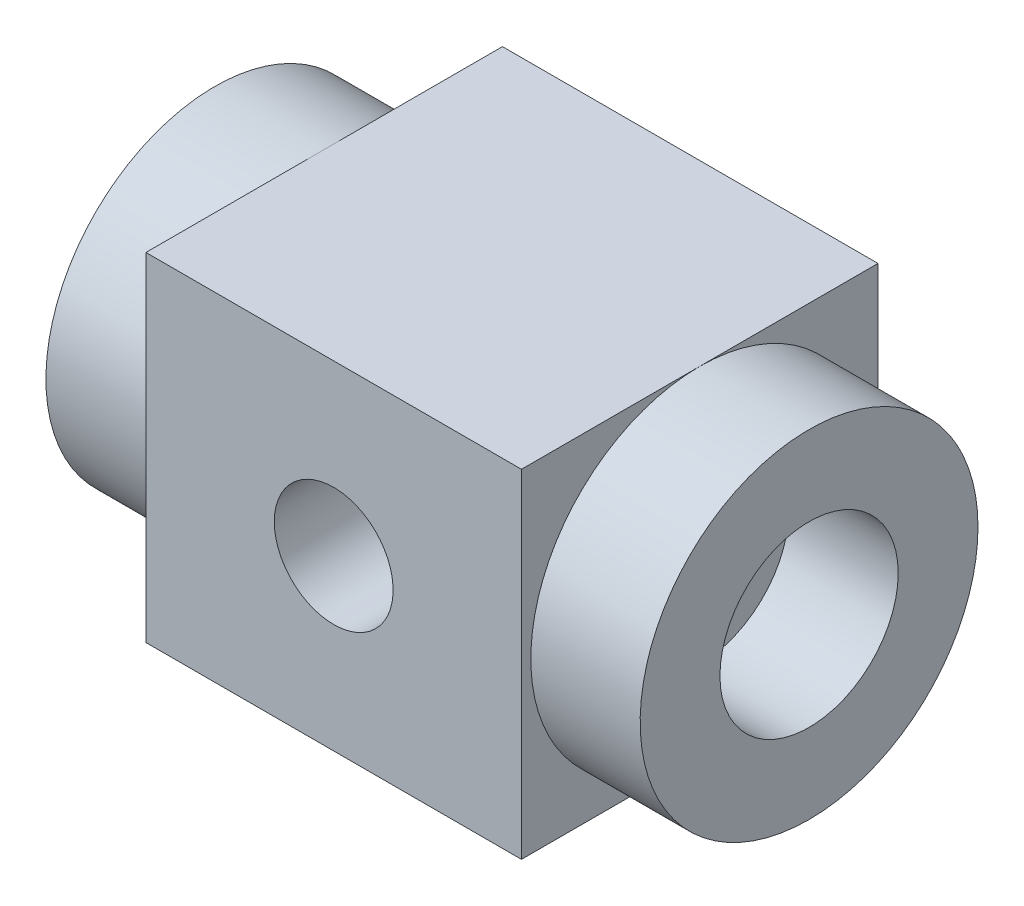
ISO-10303-21;
HEADER;
FILE_DESCRIPTION(('STEP AP214'),'2;1');
FILE_NAME('part.step','',(''),(''),'','','');
FILE_SCHEMA(('AUTOMOTIVE_DESIGN { 1 0 10303 214 1 1 1 1 }'));
ENDSEC;
DATA;
#1=APPLICATION_CONTEXT('core data for automotive mechanical design processes');
#2=APPLICATION_PROTOCOL_DEFINITION('international standard','automotive_design',2000,#1);
#3=PRODUCT_CONTEXT('',#1,'mechanical');
#4=PRODUCT('Part','Part','',(#3));
#5=PRODUCT_RELATED_PRODUCT_CATEGORY('part','',(#4));
#6=PRODUCT_DEFINITION_FORMATION('','',#4);
#7=PRODUCT_DEFINITION_CONTEXT('part definition',#1,'design');
#8=PRODUCT_DEFINITION('design','',#6,#7);
#9=PRODUCT_DEFINITION_SHAPE('','',#8);
#10=(LENGTH_UNIT() NAMED_UNIT(*) SI_UNIT(.MILLI.,.METRE.));
#11=(NAMED_UNIT(*) PLANE_ANGLE_UNIT() SI_UNIT($,.RADIAN.));
#12=(NAMED_UNIT(*) SI_UNIT($,.STERADIAN.) SOLID_ANGLE_UNIT());
#13=UNCERTAINTY_MEASURE_WITH_UNIT(LENGTH_MEASURE(1.E-05),#10,'distance_accuracy_value','');
#14=(GEOMETRIC_REPRESENTATION_CONTEXT(3) GLOBAL_UNCERTAINTY_ASSIGNED_CONTEXT((#13)) GLOBAL_UNIT_ASSIGNED_CONTEXT((#10,
#11,#12)) REPRESENTATION_CONTEXT('',''));
#15=CARTESIAN_POINT('',(0.,0.,0.));
#16=DIRECTION('',(0.,0.,1.));
#17=DIRECTION('',(1.,0.,0.));
#18=AXIS2_PLACEMENT_3D('',#15,#16,#17);
#19=CARTESIAN_POINT('',(-50.,0.,15.));
#20=DIRECTION('',(1.,0.,0.));
#21=DIRECTION('',(0.,0.,-1.));
#22=AXIS2_PLACEMENT_3D('',#19,#20,#21);
#23=CYLINDRICAL_SURFACE('',#22,7.5);
#24=CARTESIAN_POINT('',(15.8,0.,15.));
#25=DIRECTION('',(1.,0.,0.));
#26=DIRECTION('',(0.,0.,-1.));
#27=AXIS2_PLACEMENT_3D('',#24,#25,#26);
#28=CIRCLE('',#27,7.5);
#29=CARTESIAN_POINT('',(15.8,0.,7.5));
#30=VERTEX_POINT('',#29);
#31=EDGE_CURVE('E39',#30,#30,#28,.F.);
#32=ORIENTED_EDGE('',*,*,#31,.T.);
#33=EDGE_LOOP('',(#32));
#34=FACE_BOUND('',#33,.T.);
#35=CARTESIAN_POINT('',(25.,0.,15.));
#36=DIRECTION('',(1.,0.,0.));
#37=DIRECTION('',(0.,0.,-1.));
#38=AXIS2_PLACEMENT_3D('',#35,#36,#37);
#39=CIRCLE('',#38,7.5);
#40=CARTESIAN_POINT('',(25.,0.,7.5));
#41=VERTEX_POINT('',#40);
#42=EDGE_CURVE('E222',#41,#41,#39,.T.);
#43=ORIENTED_EDGE('',*,*,#42,.T.);
#44=EDGE_LOOP('',(#43));
#45=FACE_BOUND('',#44,.T.);
#46=ADVANCED_FACE('F35',(#34,#45),#23,.F.);
#47=CARTESIAN_POINT('',(-15.8,0.,15.));
#48=DIRECTION('',(-1.,0.,0.));
#49=DIRECTION('',(0.,0.,1.));
#50=AXIS2_PLACEMENT_3D('',#47,#48,#49);
#51=CIRCLE('',#50,7.5);
#52=CARTESIAN_POINT('',(-15.8,0.,22.5));
#53=VERTEX_POINT('',#52);
#54=EDGE_CURVE('E276',#53,#53,#51,.F.);
#55=ORIENTED_EDGE('',*,*,#54,.T.);
#56=EDGE_LOOP('',(#55));
#57=FACE_BOUND('',#56,.T.);
#58=CARTESIAN_POINT('',(-25.,0.,15.));
#59=DIRECTION('',(1.,0.,0.));
#60=DIRECTION('',(0.,0.,-1.));
#61=AXIS2_PLACEMENT_3D('',#58,#59,#60);
#62=CIRCLE('',#61,7.5);
#63=CARTESIAN_POINT('',(-25.,0.,7.5));
#64=VERTEX_POINT('',#63);
#65=EDGE_CURVE('E225',#64,#64,#62,.T.);
#66=ORIENTED_EDGE('',*,*,#65,.F.);
#67=EDGE_LOOP('',(#66));
#68=FACE_BOUND('',#67,.T.);
#69=ADVANCED_FACE('F186',(#57,#68),#23,.F.);
#70=CARTESIAN_POINT('',(15.8,-14.2140325133883,30.));
#71=DIRECTION('',(-1.,0.,0.));
#72=DIRECTION('',(0.,0.,1.));
#73=AXIS2_PLACEMENT_3D('',#70,#71,#72);
#74=PLANE('',#73);
#75=CARTESIAN_POINT('',(15.8,0.,15.));
#76=DIRECTION('',(-1.,0.,0.));
#77=DIRECTION('',(0.,0.,1.));
#78=AXIS2_PLACEMENT_3D('',#75,#76,#77);
#79=CIRCLE('',#78,14.2140325133883);
#80=CARTESIAN_POINT('',(15.8,-14.2140325133883,15.));
#81=VERTEX_POINT('',#80);
#82=CARTESIAN_POINT('',(15.8,14.2140325133883,15.));
#83=VERTEX_POINT('',#82);
#84=EDGE_CURVE('E125',#81,#83,#79,.F.);
#85=ORIENTED_EDGE('',*,*,#84,.F.);
#86=DIRECTION('',(0.,0.,-1.));
#87=VECTOR('',#86,1.);
#88=CARTESIAN_POINT('',(15.8,-14.2140325133883,30.));
#89=LINE('',#88,#87);
#90=CARTESIAN_POINT('',(15.8,-14.2140325133883,0.));
#91=VERTEX_POINT('',#90);
#92=EDGE_CURVE('E135',#81,#91,#89,.T.);
#93=ORIENTED_EDGE('',*,*,#92,.T.);
#94=DIRECTION('',(0.,1.,0.));
#95=VECTOR('',#94,1.);
#96=CARTESIAN_POINT('',(15.8,-14.2140325133883,0.));
#97=LINE('',#96,#95);
#98=CARTESIAN_POINT('',(15.8,14.2140325133883,0.));
#99=VERTEX_POINT('',#98);
#100=EDGE_CURVE('E136',#91,#99,#97,.T.);
#101=ORIENTED_EDGE('',*,*,#100,.T.);
#102=DIRECTION('',(0.,0.,-1.));
#103=VECTOR('',#102,1.);
#104=CARTESIAN_POINT('',(15.8,14.2140325133883,30.));
#105=LINE('',#104,#103);
#106=EDGE_CURVE('E44',#83,#99,#105,.T.);
#107=ORIENTED_EDGE('',*,*,#106,.F.);
#108=EDGE_LOOP('',(#85,#93,#101,#107));
#109=FACE_BOUND('',#108,.T.);
#110=ADVANCED_FACE('F192',(#109),#74,.F.);
#111=CARTESIAN_POINT('',(-15.8,-14.2140325133883,30.));
#112=DIRECTION('',(1.,0.,0.));
#113=DIRECTION('',(0.,0.,-1.));
#114=AXIS2_PLACEMENT_3D('',#111,#112,#113);
#115=PLANE('',#114);
#116=CARTESIAN_POINT('',(-15.8,0.,15.));
#117=DIRECTION('',(1.,0.,0.));
#118=DIRECTION('',(0.,0.,-1.));
#119=AXIS2_PLACEMENT_3D('',#116,#117,#118);
#120=CIRCLE('',#119,14.2140325133883);
#121=CARTESIAN_POINT('',(-15.8,-14.2140325133883,15.));
#122=VERTEX_POINT('',#121);
#123=CARTESIAN_POINT('',(-15.8,14.2140325133883,15.));
#124=VERTEX_POINT('',#123);
#125=EDGE_CURVE('E111',#122,#124,#120,.F.);
#126=ORIENTED_EDGE('',*,*,#125,.F.);
#127=DIRECTION('',(0.,0.,-1.));
#128=VECTOR('',#127,1.);
#129=CARTESIAN_POINT('',(-15.8,-14.2140325133883,30.));
#130=LINE('',#129,#128);
#131=CARTESIAN_POINT('',(-15.8,-14.2140325133883,30.));
#132=VERTEX_POINT('',#131);
#133=EDGE_CURVE('E93',#132,#122,#130,.T.);
#134=ORIENTED_EDGE('',*,*,#133,.F.);
#135=DIRECTION('',(0.,-1.,0.));
#136=VECTOR('',#135,1.);
#137=CARTESIAN_POINT('',(-15.8,-14.2140325133883,30.));
#138=LINE('',#137,#136);
#139=CARTESIAN_POINT('',(-15.8,14.2140325133883,30.));
#140=VERTEX_POINT('',#139);
#141=EDGE_CURVE('E132',#140,#132,#138,.T.);
#142=ORIENTED_EDGE('',*,*,#141,.F.);
#143=DIRECTION('',(0.,0.,-1.));
#144=VECTOR('',#143,1.);
#145=CARTESIAN_POINT('',(-15.8,14.2140325133883,30.));
#146=LINE('',#145,#144);
#147=EDGE_CURVE('E114',#140,#124,#146,.T.);
#148=ORIENTED_EDGE('',*,*,#147,.T.);
#149=EDGE_LOOP('',(#126,#134,#142,#148));
#150=FACE_BOUND('',#149,.T.);
#151=ADVANCED_FACE('F112',(#150),#115,.F.);
#152=EDGE_CURVE('E52',#83,#81,#79,.F.);
#153=ORIENTED_EDGE('',*,*,#152,.F.);
#154=CARTESIAN_POINT('',(15.8,14.2140325133883,30.));
#155=VERTEX_POINT('',#154);
#156=EDGE_CURVE('E11',#155,#83,#105,.T.);
#157=ORIENTED_EDGE('',*,*,#156,.F.);
#158=DIRECTION('',(0.,1.,0.));
#159=VECTOR('',#158,1.);
#160=CARTESIAN_POINT('',(15.8,-14.2140325133883,30.));
#161=LINE('',#160,#159);
#162=CARTESIAN_POINT('',(15.8,-14.2140325133883,30.));
#163=VERTEX_POINT('',#162);
#164=EDGE_CURVE('E126',#163,#155,#161,.T.);
#165=ORIENTED_EDGE('',*,*,#164,.F.);
#166=EDGE_CURVE('E108',#163,#81,#89,.T.);
#167=ORIENTED_EDGE('',*,*,#166,.T.);
#168=EDGE_LOOP('',(#153,#157,#165,#167));
#169=FACE_BOUND('',#168,.T.);
#170=ADVANCED_FACE('F37',(#169),#74,.F.);
#171=CARTESIAN_POINT('',(-15.8,14.2140325133883,30.));
#172=DIRECTION('',(0.,-1.,0.));
#173=DIRECTION('',(0.,0.,-1.));
#174=AXIS2_PLACEMENT_3D('',#171,#172,#173);
#175=PLANE('',#174);
#176=ORIENTED_EDGE('',*,*,#147,.F.);
#177=DIRECTION('',(-1.,0.,0.));
#178=VECTOR('',#177,1.);
#179=CARTESIAN_POINT('',(-15.8,14.2140325133883,30.));
#180=LINE('',#179,#178);
#181=EDGE_CURVE('E129',#155,#140,#180,.T.);
#182=ORIENTED_EDGE('',*,*,#181,.F.);
#183=ORIENTED_EDGE('',*,*,#156,.T.);
#184=ORIENTED_EDGE('',*,*,#106,.T.);
#185=DIRECTION('',(-1.,0.,0.));
#186=VECTOR('',#185,1.);
#187=CARTESIAN_POINT('',(-15.8,14.2140325133883,0.));
#188=LINE('',#187,#186);
#189=CARTESIAN_POINT('',(-15.8,14.2140325133883,0.));
#190=VERTEX_POINT('',#189);
#191=EDGE_CURVE('E139',#99,#190,#188,.T.);
#192=ORIENTED_EDGE('',*,*,#191,.T.);
#193=EDGE_CURVE('E102',#124,#190,#146,.T.);
#194=ORIENTED_EDGE('',*,*,#193,.F.);
#195=EDGE_LOOP('',(#176,#182,#183,#184,#192,#194));
#196=FACE_BOUND('',#195,.T.);
#197=ADVANCED_FACE('F256',(#196),#175,.F.);
#198=EDGE_CURVE('E60',#124,#122,#120,.F.);
#199=ORIENTED_EDGE('',*,*,#198,.F.);
#200=ORIENTED_EDGE('',*,*,#193,.T.);
#201=DIRECTION('',(0.,-1.,0.));
#202=VECTOR('',#201,1.);
#203=CARTESIAN_POINT('',(-15.8,-14.2140325133883,0.));
#204=LINE('',#203,#202);
#205=CARTESIAN_POINT('',(-15.8,-14.2140325133883,0.));
#206=VERTEX_POINT('',#205);
#207=EDGE_CURVE('E106',#190,#206,#204,.T.);
#208=ORIENTED_EDGE('',*,*,#207,.T.);
#209=EDGE_CURVE('E95',#122,#206,#130,.T.);
#210=ORIENTED_EDGE('',*,*,#209,.F.);
#211=EDGE_LOOP('',(#199,#200,#208,#210));
#212=FACE_BOUND('',#211,.T.);
#213=ADVANCED_FACE('F104',(#212),#115,.F.);
#214=CARTESIAN_POINT('',(-15.8,-14.2140325133883,30.));
#215=DIRECTION('',(0.,1.,0.));
#216=DIRECTION('',(0.,0.,1.));
#217=AXIS2_PLACEMENT_3D('',#214,#215,#216);
#218=PLANE('',#217);
#219=DIRECTION('',(1.,0.,0.));
#220=VECTOR('',#219,1.);
#221=CARTESIAN_POINT('',(-15.8,-14.2140325133883,0.));
#222=LINE('',#221,#220);
#223=EDGE_CURVE('E130',#206,#91,#222,.T.);
#224=ORIENTED_EDGE('',*,*,#223,.T.);
#225=ORIENTED_EDGE('',*,*,#92,.F.);
#226=ORIENTED_EDGE('',*,*,#166,.F.);
#227=DIRECTION('',(1.,0.,0.));
#228=VECTOR('',#227,1.);
#229=CARTESIAN_POINT('',(-15.8,-14.2140325133883,30.));
#230=LINE('',#229,#228);
#231=EDGE_CURVE('E98',#132,#163,#230,.T.);
#232=ORIENTED_EDGE('',*,*,#231,.F.);
#233=ORIENTED_EDGE('',*,*,#133,.T.);
#234=ORIENTED_EDGE('',*,*,#209,.T.);
#235=EDGE_LOOP('',(#224,#225,#226,#232,#233,#234));
#236=FACE_BOUND('',#235,.T.);
#237=ADVANCED_FACE('F94',(#236),#218,.F.);
#238=CARTESIAN_POINT('',(0.,0.,30.));
#239=DIRECTION('',(0.,0.,-1.));
#240=DIRECTION('',(-1.,0.,0.));
#241=AXIS2_PLACEMENT_3D('',#238,#239,#240);
#242=PLANE('',#241);
#243=CARTESIAN_POINT('',(0.,0.,30.));
#244=DIRECTION('',(0.,0.,-1.));
#245=DIRECTION('',(-1.,0.,0.));
#246=AXIS2_PLACEMENT_3D('',#243,#244,#245);
#247=CIRCLE('',#246,5.);
#248=CARTESIAN_POINT('',(-5.,0.,30.));
#249=VERTEX_POINT('',#248);
#250=EDGE_CURVE('E220',#249,#249,#247,.T.);
#251=ORIENTED_EDGE('',*,*,#250,.T.);
#252=EDGE_LOOP('',(#251));
#253=FACE_BOUND('',#252,.T.);
#254=ORIENTED_EDGE('',*,*,#231,.T.);
#255=ORIENTED_EDGE('',*,*,#164,.T.);
#256=ORIENTED_EDGE('',*,*,#181,.T.);
#257=ORIENTED_EDGE('',*,*,#141,.T.);
#258=EDGE_LOOP('',(#254,#255,#256,#257));
#259=FACE_BOUND('',#258,.T.);
#260=ADVANCED_FACE('F245',(#253,#259),#242,.F.);
#261=CARTESIAN_POINT('',(0.,0.,0.));
#262=DIRECTION('',(0.,0.,-1.));
#263=DIRECTION('',(-1.,0.,0.));
#264=AXIS2_PLACEMENT_3D('',#261,#262,#263);
#265=PLANE('',#264);
#266=ORIENTED_EDGE('',*,*,#207,.F.);
#267=ORIENTED_EDGE('',*,*,#191,.F.);
#268=ORIENTED_EDGE('',*,*,#100,.F.);
#269=ORIENTED_EDGE('',*,*,#223,.F.);
#270=EDGE_LOOP('',(#266,#267,#268,#269));
#271=FACE_BOUND('',#270,.T.);
#272=CARTESIAN_POINT('',(0.,0.,0.));
#273=DIRECTION('',(0.,0.,-1.));
#274=DIRECTION('',(-1.,0.,0.));
#275=AXIS2_PLACEMENT_3D('',#272,#273,#274);
#276=CIRCLE('',#275,5.);
#277=CARTESIAN_POINT('',(-5.,0.,0.));
#278=VERTEX_POINT('',#277);
#279=EDGE_CURVE('E153',#278,#278,#276,.T.);
#280=ORIENTED_EDGE('',*,*,#279,.F.);
#281=EDGE_LOOP('',(#280));
#282=FACE_BOUND('',#281,.T.);
#283=ADVANCED_FACE('F238',(#271,#282),#265,.T.);
#284=CARTESIAN_POINT('',(-25.,0.,15.));
#285=DIRECTION('',(1.,0.,0.));
#286=DIRECTION('',(0.,0.,-1.));
#287=AXIS2_PLACEMENT_3D('',#284,#285,#286);
#288=PLANE('',#287);
#289=ORIENTED_EDGE('',*,*,#65,.T.);
#290=EDGE_LOOP('',(#289));
#291=FACE_BOUND('',#290,.T.);
#292=CARTESIAN_POINT('',(-25.,0.,15.));
#293=DIRECTION('',(1.,0.,0.));
#294=DIRECTION('',(0.,0.,-1.));
#295=AXIS2_PLACEMENT_3D('',#292,#293,#294);
#296=CIRCLE('',#295,14.2140325133883);
#297=CARTESIAN_POINT('',(-25.,0.,0.785967486611664));
#298=VERTEX_POINT('',#297);
#299=EDGE_CURVE('E120',#298,#298,#296,.T.);
#300=ORIENTED_EDGE('',*,*,#299,.F.);
#301=EDGE_LOOP('',(#300));
#302=FACE_BOUND('',#301,.T.);
#303=ADVANCED_FACE('F236',(#291,#302),#288,.F.);
#304=CARTESIAN_POINT('',(25.,0.,15.));
#305=DIRECTION('',(-1.,0.,0.));
#306=DIRECTION('',(0.,0.,1.));
#307=AXIS2_PLACEMENT_3D('',#304,#305,#306);
#308=CYLINDRICAL_SURFACE('',#307,14.2140325133883);
#309=ORIENTED_EDGE('',*,*,#299,.T.);
#310=EDGE_LOOP('',(#309));
#311=FACE_BOUND('',#310,.T.);
#312=ORIENTED_EDGE('',*,*,#198,.T.);
#313=ORIENTED_EDGE('',*,*,#125,.T.);
#314=EDGE_LOOP('',(#312,#313));
#315=FACE_BOUND('',#314,.T.);
#316=ADVANCED_FACE('F117',(#311,#315),#308,.T.);
#317=CARTESIAN_POINT('',(25.,0.,15.));
#318=DIRECTION('',(1.,0.,0.));
#319=DIRECTION('',(0.,0.,-1.));
#320=AXIS2_PLACEMENT_3D('',#317,#318,#319);
#321=CIRCLE('',#320,14.2140325133883);
#322=CARTESIAN_POINT('',(25.,0.,0.785967486611664));
#323=VERTEX_POINT('',#322);
#324=EDGE_CURVE('E118',#323,#323,#321,.T.);
#325=ORIENTED_EDGE('',*,*,#324,.F.);
#326=EDGE_LOOP('',(#325));
#327=FACE_BOUND('',#326,.T.);
#328=ORIENTED_EDGE('',*,*,#152,.T.);
#329=ORIENTED_EDGE('',*,*,#84,.T.);
#330=EDGE_LOOP('',(#328,#329));
#331=FACE_BOUND('',#330,.T.);
#332=ADVANCED_FACE('F204',(#327,#331),#308,.T.);
#333=CARTESIAN_POINT('',(25.,0.,15.));
#334=DIRECTION('',(1.,0.,0.));
#335=DIRECTION('',(0.,0.,-1.));
#336=AXIS2_PLACEMENT_3D('',#333,#334,#335);
#337=PLANE('',#336);
#338=ORIENTED_EDGE('',*,*,#42,.F.);
#339=EDGE_LOOP('',(#338));
#340=FACE_BOUND('',#339,.T.);
#341=ORIENTED_EDGE('',*,*,#324,.T.);
#342=EDGE_LOOP('',(#341));
#343=FACE_BOUND('',#342,.T.);
#344=ADVANCED_FACE('F197',(#340,#343),#337,.T.);
#345=CARTESIAN_POINT('',(11.1069312823702,0.,15.));
#346=DIRECTION('',(-1.,0.,0.));
#347=DIRECTION('',(0.,0.,1.));
#348=AXIS2_PLACEMENT_3D('',#345,#346,#347);
#349=CIRCLE('',#348,7.5);
#350=CARTESIAN_POINT('',(11.1069312823702,0.,22.5));
#351=VERTEX_POINT('',#350);
#352=EDGE_CURVE('E208',#351,#351,#349,.F.);
#353=ORIENTED_EDGE('',*,*,#352,.T.);
#354=EDGE_LOOP('',(#353));
#355=FACE_BOUND('',#354,.T.);
#356=CARTESIAN_POINT('',(-11.0970374906287,0.,15.));
#357=DIRECTION('',(1.,0.,0.));
#358=DIRECTION('',(0.,0.,-1.));
#359=AXIS2_PLACEMENT_3D('',#356,#357,#358);
#360=CIRCLE('',#359,7.5);
#361=CARTESIAN_POINT('',(-11.0970374906287,0.,7.5));
#362=VERTEX_POINT('',#361);
#363=EDGE_CURVE('E212',#362,#362,#360,.F.);
#364=ORIENTED_EDGE('',*,*,#363,.T.);
#365=EDGE_LOOP('',(#364));
#366=FACE_BOUND('',#365,.T.);
#367=CARTESIAN_POINT('',(-5.,0.,7.5));
#368=CARTESIAN_POINT('',(-4.99999996332958,0.125608018588548,7.50000003679037));
#369=CARTESIAN_POINT('',(-4.99526045609656,0.251216670884861,7.50316219335514));
#370=CARTESIAN_POINT('',(-4.97637719344278,0.501407130429646,7.51573112476992));
#371=CARTESIAN_POINT('',(-4.96223338852455,0.625988932270019,7.52513793248731));
#372=CARTESIAN_POINT('',(-4.92475388496588,0.873171719994341,7.54996617658925));
#373=CARTESIAN_POINT('',(-4.90141650195336,0.99577233861483,7.56538871512163));
#374=CARTESIAN_POINT('',(-4.84587344243482,1.23813427215697,7.60188863323255));
#375=CARTESIAN_POINT('',(-4.8136639964275,1.35789435666897,7.62296841632435));
#376=CARTESIAN_POINT('',(-4.74098638489601,1.59314893798378,7.67018474624656));
#377=CARTESIAN_POINT('',(-4.70056186113887,1.70866231614512,7.69629453505072));
#378=CARTESIAN_POINT('',(-4.61181215495731,1.93546860882204,7.75309345650107));
#379=CARTESIAN_POINT('',(-4.56348389461676,2.04675985824914,7.78378437274675));
#380=CARTESIAN_POINT('',(-4.40738741786012,2.37341381762447,7.88182172739121));
#381=CARTESIAN_POINT('',(-4.28844372586616,2.58175996249981,7.95517515056491));
#382=CARTESIAN_POINT('',(-4.01334849863612,2.99324442404475,8.11932054571676));
#383=CARTESIAN_POINT('',(-3.85489609546822,3.19444057723902,8.21106410418185));
#384=CARTESIAN_POINT('',(-3.51065910883303,3.56933031224002,8.40045565094119));
#385=CARTESIAN_POINT('',(-3.32483536621252,3.74298373794807,8.4981119785256));
#386=CARTESIAN_POINT('',(-3.01202024399453,3.99366214280298,8.65080371990078));
#387=CARTESIAN_POINT('',(-2.89316385177453,4.08060552383283,8.70648688263264));
#388=CARTESIAN_POINT('',(-2.6475199343164,4.24410607449973,8.81556549719051));
#389=CARTESIAN_POINT('',(-2.52073061769334,4.32066088576891,8.86896042767595));
#390=CARTESIAN_POINT('',(-2.12929062591451,4.53366662201286,9.02284445710023));
#391=CARTESIAN_POINT('',(-1.85293596756271,4.65396866792279,9.11735915956302));
#392=CARTESIAN_POINT('',(-1.3581492370559,4.81686735383668,9.25059933821102));
#393=CARTESIAN_POINT('',(-1.1460313437967,4.87187088253824,9.29755361661256));
#394=CARTESIAN_POINT('',(-0.821257693119102,4.93332515657475,9.35084094866673));
#395=CARTESIAN_POINT('',(-0.711934830996303,4.95029943249,9.36574410293033));
#396=CARTESIAN_POINT('',(-0.491757384373762,4.97699249744458,9.38930703359251));
#397=CARTESIAN_POINT('',(-0.38090336452041,4.98671389202271,9.3979690520302));
#398=CARTESIAN_POINT('',(-0.157992425508245,4.99875512937179,9.40871113603933));
#399=CARTESIAN_POINT('',(-0.0459323775790787,5.00104278396599,9.41076257742014));
#400=CARTESIAN_POINT('',(0.17800706469552,4.9980849918467,9.4081174549233));
#401=CARTESIAN_POINT('',(0.289886458426012,4.99283951954458,9.40342086812384));
#402=CARTESIAN_POINT('',(0.512636091336137,4.97490634187684,9.38747379551877));
#403=CARTESIAN_POINT('',(0.623505741850758,4.96221454627213,9.37621970772437));
#404=CARTESIAN_POINT('',(0.843396564451179,4.92961024185719,9.34761949325148));
#405=CARTESIAN_POINT('',(0.952416967563864,4.90969480272766,9.33027089438388));
#406=CARTESIAN_POINT('',(1.26603456504467,4.84163703367357,9.27181923088163));
#407=CARTESIAN_POINT('',(1.46736629283408,4.78429713380928,9.22346297873666));
#408=CARTESIAN_POINT('',(1.85759628783405,4.64674861534595,9.11225924513922));
#409=CARTESIAN_POINT('',(2.0464904385054,4.56653247162609,9.04940699654455));
#410=CARTESIAN_POINT('',(2.44754530140424,4.36685173998334,8.90089732538514));
#411=CARTESIAN_POINT('',(2.65662327497203,4.24272264703471,8.81320164208068));
#412=CARTESIAN_POINT('',(3.05348499728715,3.96670264496565,8.63270195917921));
#413=CARTESIAN_POINT('',(3.24124201432436,3.81477749526626,8.53989175890166));
#414=CARTESIAN_POINT('',(3.52437255800004,3.54969108213473,8.39220836286001));
#415=CARTESIAN_POINT('',(3.62713083172277,3.44464766421749,8.33671152217496));
#416=CARTESIAN_POINT('',(3.82347713970009,3.22531791748826,8.22782945515688));
#417=CARTESIAN_POINT('',(3.9170678798286,3.11103433427816,8.17444360853742));
#418=CARTESIAN_POINT('',(4.09438233562589,2.87366828778324,8.07116311017643));
#419=CARTESIAN_POINT('',(4.17811080427028,2.75059010925358,8.02126678146288));
#420=CARTESIAN_POINT('',(4.33494297641303,2.49611507932345,7.92625711384239));
#421=CARTESIAN_POINT('',(4.40804990259985,2.36472076856899,7.88114232529404));
#422=CARTESIAN_POINT('',(4.52955003710702,2.12083178608808,7.8052073887878));
#423=CARTESIAN_POINT('',(4.57997874330749,2.00967972723592,7.77331854804337));
#424=CARTESIAN_POINT('',(4.67290941874381,1.78295269143194,7.7140683399084));
#425=CARTESIAN_POINT('',(4.71541299299982,1.66737861576613,7.68670605591363));
#426=CARTESIAN_POINT('',(4.79200645983731,1.43245611415626,7.63708787251338));
#427=CARTESIAN_POINT('',(4.82609989626979,1.31310930196114,7.61482982257275));
#428=CARTESIAN_POINT('',(4.88544867675417,1.07138735730615,7.57591038206266));
#429=CARTESIAN_POINT('',(4.91070757446615,0.949013463736593,7.55924674127156));
#430=CARTESIAN_POINT('',(4.95214332041752,0.701493288803492,7.5318355325671));
#431=CARTESIAN_POINT('',(4.96827800575267,0.576336870259733,7.5211154341007));
#432=CARTESIAN_POINT('',(4.9910386561188,0.324780008160031,7.5059760851987));
#433=CARTESIAN_POINT('',(4.99766460872505,0.198379562978778,7.50155684299621));
#434=CARTESIAN_POINT('',(5.00130194416532,-0.0546163050195371,7.49913210195937));
#435=CARTESIAN_POINT('',(4.99831372327676,-0.181211719585367,7.50112633877397));
#436=CARTESIAN_POINT('',(4.98277210202707,-0.433544937832565,7.51147648052579));
#437=CARTESIAN_POINT('',(4.97021910991058,-0.559282777885926,7.51983211394515));
#438=CARTESIAN_POINT('',(4.93696015755831,-0.800084092730021,7.54188819199651));
#439=CARTESIAN_POINT('',(4.91689203663253,-0.915274689503105,7.55516986165951));
#440=CARTESIAN_POINT('',(4.86892255510859,-1.14332502618366,7.58676272605765));
#441=CARTESIAN_POINT('',(4.84101854153162,-1.25618396274926,7.60507562415783));
#442=CARTESIAN_POINT('',(4.74603269888999,-1.59016819827962,7.66702800598835));
#443=CARTESIAN_POINT('',(4.66764915658682,-1.80689828647146,7.71770014311743));
#444=CARTESIAN_POINT('',(4.47836285798313,-2.23669773147039,7.83759432947193));
#445=CARTESIAN_POINT('',(4.36577789105498,-2.44875011842611,7.90775409298277));
#446=CARTESIAN_POINT('',(4.11391849994205,-2.8516978970661,8.05995276281076));
#447=CARTESIAN_POINT('',(3.97462759270444,-3.0425801069499,8.14199899784079));
#448=CARTESIAN_POINT('',(3.64847975744913,-3.42963933761377,8.32613661400224));
#449=CARTESIAN_POINT('',(3.45758419366079,-3.62188054324072,8.42934615408674));
#450=CARTESIAN_POINT('',(3.04722158136621,-3.97334834714671,8.63572059870919));
#451=CARTESIAN_POINT('',(2.82773495453725,-4.13255212685988,8.73888542360841));
#452=CARTESIAN_POINT('',(2.38214392019828,-4.40311961015302,8.92650804033213));
#453=CARTESIAN_POINT('',(2.15816986386051,-4.51739093945807,9.01181006814551));
#454=CARTESIAN_POINT('',(1.69031842127984,-4.71240530724639,9.16402564954684));
#455=CARTESIAN_POINT('',(1.44647781589623,-4.79320869285461,9.23097222607863));
#456=CARTESIAN_POINT('',(0.988588649429977,-4.90589604497064,9.32666976318299));
#457=CARTESIAN_POINT('',(0.77707002791512,-4.94396476310193,9.36012493623615));
#458=CARTESIAN_POINT('',(0.348567243612229,-4.99248032394649,9.40301345214931));
#459=CARTESIAN_POINT('',(0.131589276518503,-5.00295716862677,9.41247288631448));
#460=CARTESIAN_POINT('',(-0.301609297155849,-4.99559738764621,9.40589455099195));
#461=CARTESIAN_POINT('',(-0.517829379343261,-4.97774399693959,9.38984168402499));
#462=CARTESIAN_POINT('',(-0.943352637174755,-4.91492740617482,9.33474026029528));
#463=CARTESIAN_POINT('',(-1.15264619119367,-4.8699280383881,9.2956610261521));
#464=CARTESIAN_POINT('',(-1.61430721309,-4.73981418276009,9.18682147540928));
#465=CARTESIAN_POINT('',(-1.86329193737393,-4.64720557432273,9.11166051350204));
#466=CARTESIAN_POINT('',(-2.2197721527126,-4.48217153169634,8.9862717783846));
#467=CARTESIAN_POINT('',(-2.33588098122704,-4.4227291606703,8.94231391556002));
#468=CARTESIAN_POINT('',(-2.5622633756569,-4.29553797555823,8.85146561519782));
#469=CARTESIAN_POINT('',(-2.67253683284726,-4.22778900678103,8.80457512305475));
#470=CARTESIAN_POINT('',(-2.99813157273273,-4.0100125161287,8.6596176630046));
#471=CARTESIAN_POINT('',(-3.20406498890246,-3.84739387541879,8.55880760565277));
#472=CARTESIAN_POINT('',(-3.49223623047968,-3.58070368138864,8.40917051456721));
#473=CARTESIAN_POINT('',(-3.5848751310009,-3.48796686520543,8.35953272853694));
#474=CARTESIAN_POINT('',(-3.76298200605057,-3.29502624182908,8.26171529300943));
#475=CARTESIAN_POINT('',(-3.84844834415119,-3.1948207404404,8.21353597785813));
#476=CARTESIAN_POINT('',(-4.02347385839298,-2.97228582382092,8.11287389677783));
#477=CARTESIAN_POINT('',(-4.11184847540997,-2.84884898400047,8.06077127221475));
#478=CARTESIAN_POINT('',(-4.27770219318705,-2.59315796105784,7.96122599423589));
#479=CARTESIAN_POINT('',(-4.35518622493486,-2.46090780863047,7.91378123480699));
#480=CARTESIAN_POINT('',(-4.49830278427693,-2.18836443414478,7.82493314178937));
#481=CARTESIAN_POINT('',(-4.5639463557069,-2.04807886951547,7.78352418547776));
#482=CARTESIAN_POINT('',(-4.68245428044414,-1.76034275764726,7.70799812986902));
#483=CARTESIAN_POINT('',(-4.73532312146547,-1.61289474847383,7.67387847035909));
#484=CARTESIAN_POINT('',(-4.81710032821547,-1.34555428333911,7.62072352187776));
#485=CARTESIAN_POINT('',(-4.84872238892977,-1.22681585673933,7.60002106417574));
#486=CARTESIAN_POINT('',(-4.90325435730034,-0.9865412189167,7.56417594239469));
#487=CARTESIAN_POINT('',(-4.9261660555379,-0.865005588166454,7.54903213565095));
#488=CARTESIAN_POINT('',(-4.96294834023699,-0.620058880061073,7.52466277781778));
#489=CARTESIAN_POINT('',(-4.97682430043646,-0.496648962158441,7.51543370916455));
#490=CARTESIAN_POINT('',(-4.99535032150822,-0.24882626170185,7.50310218713229));
#491=CARTESIAN_POINT('',(-5.00000003632167,-0.12441344170668,7.49999996355952));
#492=CARTESIAN_POINT('',(-5.,0.,7.5));
#493=B_SPLINE_CURVE_WITH_KNOTS('',3,(#367,#368,#369,#370,#371,#372,#373,#374,#375,#376,#377,
#378,#379,#380,#381,#382,#383,#384,#385,#386,#387,#388,#389,#390,#391,#392,#393,#394,#395,#396,
#397,#398,#399,#400,#401,#402,#403,#404,#405,#406,#407,#408,#409,#410,#411,#412,#413,#414,#415,
#416,#417,#418,#419,#420,#421,#422,#423,#424,#425,#426,#427,#428,#429,#430,#431,#432,#433,#434,
#435,#436,#437,#438,#439,#440,#441,#442,#443,#444,#445,#446,#447,#448,#449,#450,#451,#452,#453,
#454,#455,#456,#457,#458,#459,#460,#461,#462,#463,#464,#465,#466,#467,#468,#469,#470,#471,#472,
#473,#474,#475,#476,#477,#478,#479,#480,#481,#482,#483,#484,#485,#486,#487,#488,#489,#490,#491,
#492),.UNSPECIFIED.,.T.,.F.,(4,2,2,2,2,2,2,2,2,2,2,2,2,2,2,2,2,2,2,2,2,2,2,2,2,2,2,2,2,2,2,2,2,
2,2,2,2,2,2,2,2,2,2,2,2,2,2,2,2,2,2,2,2,2,2,2,2,2,2,2,2,2,4),(0.,0.376697150092868,
0.7533962828654,1.13016446348966,1.5070929703719,1.88206910413628,2.2571916123895,
3.00679232609858,3.82000195441008,4.63438651949459,5.10618372652057,5.57808786035318,
6.5193034140896,7.18876311985435,7.52328813363274,7.85769291407032,8.19354375486222,
8.52939573647986,8.86543237335315,9.20160547846822,9.84356710192613,10.4857401421745,
11.2585349135694,12.0322881415489,12.5030398312138,12.9736521532471,13.44403673454,
13.9142782967794,14.2923626335413,14.6703703162267,15.0482184414745,15.4259144034603,
15.8053417246618,16.184769541648,16.5641817195628,16.9435777042718,17.2962009039366,
17.6489436346054,18.3538353932503,19.1014251855315,19.8494778884236,20.7158209183258,
21.5827603441875,22.3763648974054,23.1685321808116,23.8182177151969,24.4671965231208,
25.1165595219072,25.7667896111035,26.5902817323984,27.0029102138176,27.4155463806554,
28.2552096763187,28.6754157798874,29.0957174947647,29.5765774176914,30.0572189128906,
30.5374097593981,31.0174316706402,31.3908313299587,31.7641541882901,32.1372548206283,
32.5103694469936),.UNSPECIFIED.);
#494=CARTESIAN_POINT('',(-5.,0.,7.5));
#495=VERTEX_POINT('',#494);
#496=EDGE_CURVE('E152',#495,#495,#493,.T.);
#497=ORIENTED_EDGE('',*,*,#496,.T.);
#498=EDGE_LOOP('',(#497));
#499=FACE_BOUND('',#498,.T.);
#500=CARTESIAN_POINT('',(-5.,0.,22.5));
#501=CARTESIAN_POINT('',(-4.99999996332958,-0.125608018588548,22.4999999632096));
#502=CARTESIAN_POINT('',(-4.99526045609656,-0.251216670884861,22.4968378066449));
#503=CARTESIAN_POINT('',(-4.97637719344278,-0.501407130429646,22.4842688752301));
#504=CARTESIAN_POINT('',(-4.96223338852455,-0.625988932270019,22.4748620675127));
#505=CARTESIAN_POINT('',(-4.92475388496588,-0.873171719994341,22.4500338234108));
#506=CARTESIAN_POINT('',(-4.90141650195336,-0.99577233861483,22.4346112848784));
#507=CARTESIAN_POINT('',(-4.84587344243482,-1.23813427215697,22.3981113667674));
#508=CARTESIAN_POINT('',(-4.8136639964275,-1.35789435666897,22.3770315836756));
#509=CARTESIAN_POINT('',(-4.74098638489601,-1.59314893798378,22.3298152537534));
#510=CARTESIAN_POINT('',(-4.70056186113887,-1.70866231614512,22.3037054649493));
#511=CARTESIAN_POINT('',(-4.61181215495731,-1.93546860882204,22.2469065434989));
#512=CARTESIAN_POINT('',(-4.56348389461676,-2.04675985824915,22.2162156272533));
#513=CARTESIAN_POINT('',(-4.40738741786012,-2.37341381762447,22.1181782726088));
#514=CARTESIAN_POINT('',(-4.28844372586616,-2.58175996249981,22.0448248494351));
#515=CARTESIAN_POINT('',(-4.01334849863612,-2.99324442404475,21.8806794542832));
#516=CARTESIAN_POINT('',(-3.85489609546822,-3.19444057723902,21.7889358958181));
#517=CARTESIAN_POINT('',(-3.51065910883303,-3.56933031224002,21.5995443490588));
#518=CARTESIAN_POINT('',(-3.32483536621252,-3.74298373794807,21.5018880214744));
#519=CARTESIAN_POINT('',(-3.01202024399453,-3.99366214280298,21.3491962800992));
#520=CARTESIAN_POINT('',(-2.89316385177453,-4.08060552383283,21.2935131173674));
#521=CARTESIAN_POINT('',(-2.6475199343164,-4.24410607449973,21.1844345028095));
#522=CARTESIAN_POINT('',(-2.52073061769333,-4.32066088576892,21.131039572324));
#523=CARTESIAN_POINT('',(-2.12929062591451,-4.53366662201286,20.9771555428998));
#524=CARTESIAN_POINT('',(-1.85293596756271,-4.65396866792279,20.882640840437));
#525=CARTESIAN_POINT('',(-1.3581492370559,-4.81686735383668,20.749400661789));
#526=CARTESIAN_POINT('',(-1.1460313437967,-4.87187088253824,20.7024463833874));
#527=CARTESIAN_POINT('',(-0.8212576931191,-4.93332515657475,20.6491590513333));
#528=CARTESIAN_POINT('',(-0.711934830996301,-4.95029943249,20.6342558970697));
#529=CARTESIAN_POINT('',(-0.49175738437376,-4.97699249744458,20.6106929664075));
#530=CARTESIAN_POINT('',(-0.380903364520408,-4.98671389202271,20.6020309479698));
#531=CARTESIAN_POINT('',(-0.157992425508244,-4.99875512937179,20.5912888639607));
#532=CARTESIAN_POINT('',(-0.0459323775790785,-5.00104278396599,20.5892374225799));
#533=CARTESIAN_POINT('',(0.17800706469552,-4.9980849918467,20.5918825450767));
#534=CARTESIAN_POINT('',(0.289886458426011,-4.99283951954458,20.5965791318762));
#535=CARTESIAN_POINT('',(0.512636091336137,-4.97490634187683,20.6125262044812));
#536=CARTESIAN_POINT('',(0.623505741850759,-4.96221454627213,20.6237802922756));
#537=CARTESIAN_POINT('',(0.843396564451181,-4.92961024185719,20.6523805067485));
#538=CARTESIAN_POINT('',(0.952416967563866,-4.90969480272766,20.6697291056161));
#539=CARTESIAN_POINT('',(1.26603456504467,-4.84163703367357,20.7281807691184));
#540=CARTESIAN_POINT('',(1.46736629283408,-4.78429713380928,20.7765370212633));
#541=CARTESIAN_POINT('',(1.85759628783405,-4.64674861534595,20.8877407548608));
#542=CARTESIAN_POINT('',(2.0464904385054,-4.56653247162609,20.9505930034554));
#543=CARTESIAN_POINT('',(2.44754530140425,-4.36685173998334,21.0991026746149));
#544=CARTESIAN_POINT('',(2.65662327497203,-4.24272264703471,21.1867983579193));
#545=CARTESIAN_POINT('',(3.05348499728716,-3.96670264496565,21.3672980408208));
#546=CARTESIAN_POINT('',(3.24124201432436,-3.81477749526626,21.4601082410983));
#547=CARTESIAN_POINT('',(3.52437255800004,-3.54969108213473,21.60779163714));
#548=CARTESIAN_POINT('',(3.62713083172278,-3.44464766421748,21.663288477825));
#549=CARTESIAN_POINT('',(3.82347713970009,-3.22531791748826,21.7721705448431));
#550=CARTESIAN_POINT('',(3.9170678798286,-3.11103433427816,21.8255563914626));
#551=CARTESIAN_POINT('',(4.09438233562589,-2.87366828778323,21.9288368898236));
#552=CARTESIAN_POINT('',(4.17811080427028,-2.75059010925358,21.9787332185371));
#553=CARTESIAN_POINT('',(4.33494297641303,-2.49611507932344,22.0737428861576));
#554=CARTESIAN_POINT('',(4.40804990259985,-2.36472076856899,22.118857674706));
#555=CARTESIAN_POINT('',(4.52955003710703,-2.12083178608807,22.1947926112122));
#556=CARTESIAN_POINT('',(4.5799787433075,-2.00967972723592,22.2266814519566));
#557=CARTESIAN_POINT('',(4.67290941874381,-1.78295269143193,22.2859316600916));
#558=CARTESIAN_POINT('',(4.71541299299982,-1.66737861576612,22.3132939440864));
#559=CARTESIAN_POINT('',(4.79200645983731,-1.43245611415625,22.3629121274866));
#560=CARTESIAN_POINT('',(4.82609989626979,-1.31310930196114,22.3851701774272));
#561=CARTESIAN_POINT('',(4.88544867675417,-1.07138735730615,22.4240896179373));
#562=CARTESIAN_POINT('',(4.91070757446615,-0.949013463736589,22.4407532587284));
#563=CARTESIAN_POINT('',(4.95214332041752,-0.701493288803489,22.4681644674329));
#564=CARTESIAN_POINT('',(4.96827800575267,-0.576336870259729,22.4788845658993));
#565=CARTESIAN_POINT('',(4.9910386561188,-0.324780008160028,22.4940239148013));
#566=CARTESIAN_POINT('',(4.99766460872505,-0.198379562978775,22.4984431570038));
#567=CARTESIAN_POINT('',(5.00130194416532,0.0546163050195404,22.5008678980406));
#568=CARTESIAN_POINT('',(4.99831372327676,0.18121171958537,22.498873661226));
#569=CARTESIAN_POINT('',(4.98277210202707,0.433544937832568,22.4885235194742));
#570=CARTESIAN_POINT('',(4.97021910991058,0.559282777885929,22.4801678860549));
#571=CARTESIAN_POINT('',(4.93696015755831,0.800084092730024,22.4581118080035));
#572=CARTESIAN_POINT('',(4.91689203663253,0.915274689503109,22.4448301383405));
#573=CARTESIAN_POINT('',(4.86892255510859,1.14332502618366,22.4132372739424));
#574=CARTESIAN_POINT('',(4.84101854153162,1.25618396274926,22.3949243758422));
#575=CARTESIAN_POINT('',(4.74603269888999,1.59016819827962,22.3329719940117));
#576=CARTESIAN_POINT('',(4.66764915658682,1.80689828647146,22.2822998568826));
#577=CARTESIAN_POINT('',(4.47836285798313,2.23669773147039,22.1624056705281));
#578=CARTESIAN_POINT('',(4.36577789105498,2.44875011842611,22.0922459070172));
#579=CARTESIAN_POINT('',(4.11391849994205,2.8516978970661,21.9400472371892));
#580=CARTESIAN_POINT('',(3.97462759270444,3.0425801069499,21.8580010021592));
#581=CARTESIAN_POINT('',(3.64847975744913,3.42963933761377,21.6738633859978));
#582=CARTESIAN_POINT('',(3.45758419366078,3.62188054324072,21.5706538459133));
#583=CARTESIAN_POINT('',(3.04722158136621,3.97334834714671,21.3642794012908));
#584=CARTESIAN_POINT('',(2.82773495453724,4.13255212685988,21.2611145763916));
#585=CARTESIAN_POINT('',(2.38214392019828,4.40311961015302,21.0734919596679));
#586=CARTESIAN_POINT('',(2.15816986386051,4.51739093945807,20.9881899318545));
#587=CARTESIAN_POINT('',(1.69031842127984,4.71240530724639,20.8359743504532));
#588=CARTESIAN_POINT('',(1.44647781589623,4.79320869285461,20.7690277739214));
#589=CARTESIAN_POINT('',(0.988588649429976,4.90589604497064,20.673330236817));
#590=CARTESIAN_POINT('',(0.777070027915119,4.94396476310194,20.6398750637639));
#591=CARTESIAN_POINT('',(0.348567243612228,4.99248032394649,20.5969865478507));
#592=CARTESIAN_POINT('',(0.131589276518502,5.00295716862677,20.5875271136855));
#593=CARTESIAN_POINT('',(-0.301609297155848,4.99559738764621,20.5941054490081));
#594=CARTESIAN_POINT('',(-0.517829379343259,4.97774399693959,20.610158315975));
#595=CARTESIAN_POINT('',(-0.943352637174753,4.91492740617482,20.6652597397047));
#596=CARTESIAN_POINT('',(-1.15264619119367,4.8699280383881,20.7043389738479));
#597=CARTESIAN_POINT('',(-1.61430721309,4.73981418276009,20.8131785245907));
#598=CARTESIAN_POINT('',(-1.86329193737393,4.64720557432273,20.888339486498));
#599=CARTESIAN_POINT('',(-2.2197721527126,4.48217153169634,21.0137282216154));
#600=CARTESIAN_POINT('',(-2.33588098122704,4.4227291606703,21.05768608444));
#601=CARTESIAN_POINT('',(-2.5622633756569,4.29553797555823,21.1485343848022));
#602=CARTESIAN_POINT('',(-2.67253683284726,4.22778900678103,21.1954248769452));
#603=CARTESIAN_POINT('',(-2.99813157273273,4.0100125161287,21.3403823369954));
#604=CARTESIAN_POINT('',(-3.20406498890246,3.84739387541879,21.4411923943472));
#605=CARTESIAN_POINT('',(-3.49223623047968,3.58070368138863,21.5908294854328));
#606=CARTESIAN_POINT('',(-3.5848751310009,3.48796686520542,21.6404672714631));
#607=CARTESIAN_POINT('',(-3.76298200605057,3.29502624182908,21.7382847069906));
#608=CARTESIAN_POINT('',(-3.84844834415119,3.1948207404404,21.7864640221419));
#609=CARTESIAN_POINT('',(-4.02347385839298,2.97228582382092,21.8871261032222));
#610=CARTESIAN_POINT('',(-4.11184847540997,2.84884898400047,21.9392287277853));
#611=CARTESIAN_POINT('',(-4.27770219318705,2.59315796105784,22.0387740057641));
#612=CARTESIAN_POINT('',(-4.35518622493486,2.46090780863047,22.086218765193));
#613=CARTESIAN_POINT('',(-4.49830278427693,2.18836443414478,22.1750668582106));
#614=CARTESIAN_POINT('',(-4.5639463557069,2.04807886951548,22.2164758145222));
#615=CARTESIAN_POINT('',(-4.68245428044414,1.76034275764726,22.292001870131));
#616=CARTESIAN_POINT('',(-4.73532312146547,1.61289474847384,22.3261215296409));
#617=CARTESIAN_POINT('',(-4.81710032821547,1.34555428333912,22.3792764781222));
#618=CARTESIAN_POINT('',(-4.84872238892977,1.22681585673933,22.3999789358243));
#619=CARTESIAN_POINT('',(-4.90325435730034,0.986541218916702,22.4358240576053));
#620=CARTESIAN_POINT('',(-4.9261660555379,0.865005588166456,22.450967864349));
#621=CARTESIAN_POINT('',(-4.96294834023699,0.620058880061076,22.4753372221822));
#622=CARTESIAN_POINT('',(-4.97682430043646,0.496648962158446,22.4845662908354));
#623=CARTESIAN_POINT('',(-4.99535032150822,0.248826261701855,22.4968978128677));
#624=CARTESIAN_POINT('',(-5.00000003632167,0.124413441706682,22.5000000364405));
#625=CARTESIAN_POINT('',(-5.,0.,22.5));
#626=B_SPLINE_CURVE_WITH_KNOTS('',3,(#500,#501,#502,#503,#504,#505,#506,#507,#508,#509,#510,
#511,#512,#513,#514,#515,#516,#517,#518,#519,#520,#521,#522,#523,#524,#525,#526,#527,#528,#529,
#530,#531,#532,#533,#534,#535,#536,#537,#538,#539,#540,#541,#542,#543,#544,#545,#546,#547,#548,
#549,#550,#551,#552,#553,#554,#555,#556,#557,#558,#559,#560,#561,#562,#563,#564,#565,#566,#567,
#568,#569,#570,#571,#572,#573,#574,#575,#576,#577,#578,#579,#580,#581,#582,#583,#584,#585,#586,
#587,#588,#589,#590,#591,#592,#593,#594,#595,#596,#597,#598,#599,#600,#601,#602,#603,#604,#605,
#606,#607,#608,#609,#610,#611,#612,#613,#614,#615,#616,#617,#618,#619,#620,#621,#622,#623,#624,
#625),.UNSPECIFIED.,.T.,.F.,(4,2,2,2,2,2,2,2,2,2,2,2,2,2,2,2,2,2,2,2,2,2,2,2,2,2,2,2,2,2,2,2,2,
2,2,2,2,2,2,2,2,2,2,2,2,2,2,2,2,2,2,2,2,2,2,2,2,2,2,2,2,2,4),(0.,0.376697150092868,
0.7533962828654,1.13016446348966,1.5070929703719,1.88206910413628,2.2571916123895,
3.00679232609858,3.82000195441008,4.63438651949459,5.10618372652057,5.57808786035319,
6.5193034140896,7.18876311985435,7.52328813363274,7.85769291407032,8.19354375486222,
8.52939573647986,8.86543237335315,9.20160547846822,9.84356710192613,10.4857401421745,
11.2585349135694,12.032288141549,12.5030398312138,12.9736521532471,13.44403673454,
13.9142782967795,14.2923626335413,14.6703703162267,15.0482184414745,15.4259144034603,
15.8053417246619,16.184769541648,16.5641817195628,16.9435777042718,17.2962009039366,
17.6489436346054,18.3538353932503,19.1014251855315,19.8494778884236,20.7158209183258,
21.5827603441875,22.3763648974054,23.1685321808116,23.8182177151969,24.4671965231208,
25.1165595219072,25.7667896111035,26.5902817323984,27.0029102138176,27.4155463806554,
28.2552096763187,28.6754157798874,29.0957174947647,29.5765774176914,30.0572189128906,
30.5374097593981,31.0174316706402,31.3908313299587,31.7641541882901,32.1372548206284,
32.5103694469937),.UNSPECIFIED.);
#627=CARTESIAN_POINT('',(-5.,0.,22.5));
#628=VERTEX_POINT('',#627);
#629=EDGE_CURVE('E145',#628,#628,#626,.T.);
#630=ORIENTED_EDGE('',*,*,#629,.T.);
#631=EDGE_LOOP('',(#630));
#632=FACE_BOUND('',#631,.T.);
#633=ADVANCED_FACE('F157',(#355,#366,#499,#632),#23,.F.);
#634=CARTESIAN_POINT('',(0.,0.,75.));
#635=DIRECTION('',(0.,0.,-1.));
#636=DIRECTION('',(-1.,0.,0.));
#637=AXIS2_PLACEMENT_3D('',#634,#635,#636);
#638=CYLINDRICAL_SURFACE('',#637,5.);
#639=ORIENTED_EDGE('',*,*,#629,.F.);
#640=EDGE_LOOP('',(#639));
#641=FACE_BOUND('',#640,.T.);
#642=ORIENTED_EDGE('',*,*,#250,.F.);
#643=EDGE_LOOP('',(#642));
#644=FACE_BOUND('',#643,.T.);
#645=ADVANCED_FACE('F160',(#641,#644),#638,.F.);
#646=ORIENTED_EDGE('',*,*,#279,.T.);
#647=EDGE_LOOP('',(#646));
#648=FACE_BOUND('',#647,.T.);
#649=ORIENTED_EDGE('',*,*,#496,.F.);
#650=EDGE_LOOP('',(#649));
#651=FACE_BOUND('',#650,.T.);
#652=ADVANCED_FACE('F164',(#648,#651),#638,.F.);
#653=CARTESIAN_POINT('',(-11.0970374906287,-14.2140325133883,0.));
#654=DIRECTION('',(1.,0.,0.));
#655=DIRECTION('',(0.,0.,-1.));
#656=AXIS2_PLACEMENT_3D('',#653,#654,#655);
#657=PLANE('',#656);
#658=ORIENTED_EDGE('',*,*,#363,.F.);
#659=EDGE_LOOP('',(#658));
#660=FACE_BOUND('',#659,.T.);
#661=ADVANCED_FACE('F171',(#660),#657,.T.);
#662=CARTESIAN_POINT('',(-15.8,-14.2140325133883,0.));
#663=DIRECTION('',(-1.,0.,0.));
#664=DIRECTION('',(0.,0.,1.));
#665=AXIS2_PLACEMENT_3D('',#662,#663,#664);
#666=PLANE('',#665);
#667=ORIENTED_EDGE('',*,*,#54,.F.);
#668=EDGE_LOOP('',(#667));
#669=FACE_BOUND('',#668,.T.);
#670=ADVANCED_FACE('F166',(#669),#666,.T.);
#671=CARTESIAN_POINT('',(11.1069312823702,-14.2140325133883,30.));
#672=DIRECTION('',(-1.,0.,0.));
#673=DIRECTION('',(0.,0.,1.));
#674=AXIS2_PLACEMENT_3D('',#671,#672,#673);
#675=PLANE('',#674);
#676=ORIENTED_EDGE('',*,*,#352,.F.);
#677=EDGE_LOOP('',(#676));
#678=FACE_BOUND('',#677,.T.);
#679=ADVANCED_FACE('F170',(#678),#675,.T.);
#680=CARTESIAN_POINT('',(15.8,-14.2140325133883,30.));
#681=DIRECTION('',(1.,0.,0.));
#682=DIRECTION('',(0.,0.,-1.));
#683=AXIS2_PLACEMENT_3D('',#680,#681,#682);
#684=PLANE('',#683);
#685=ORIENTED_EDGE('',*,*,#31,.F.);
#686=EDGE_LOOP('',(#685));
#687=FACE_BOUND('',#686,.T.);
#688=ADVANCED_FACE('F176',(#687),#684,.T.);
#689=CLOSED_SHELL('',(#46,#69,#110,#151,#170,#197,#213,#237,#260,#283,#303,#316,#332,#344,#633,
#645,#652,#661,#670,#679,#688));
#690=MANIFOLD_SOLID_BREP('B2',#689);
#691=ADVANCED_BREP_SHAPE_REPRESENTATION('',(#18,#690),#14);
#692=SHAPE_DEFINITION_REPRESENTATION(#9,#691);
ENDSEC;
END-ISO-10303-21;
